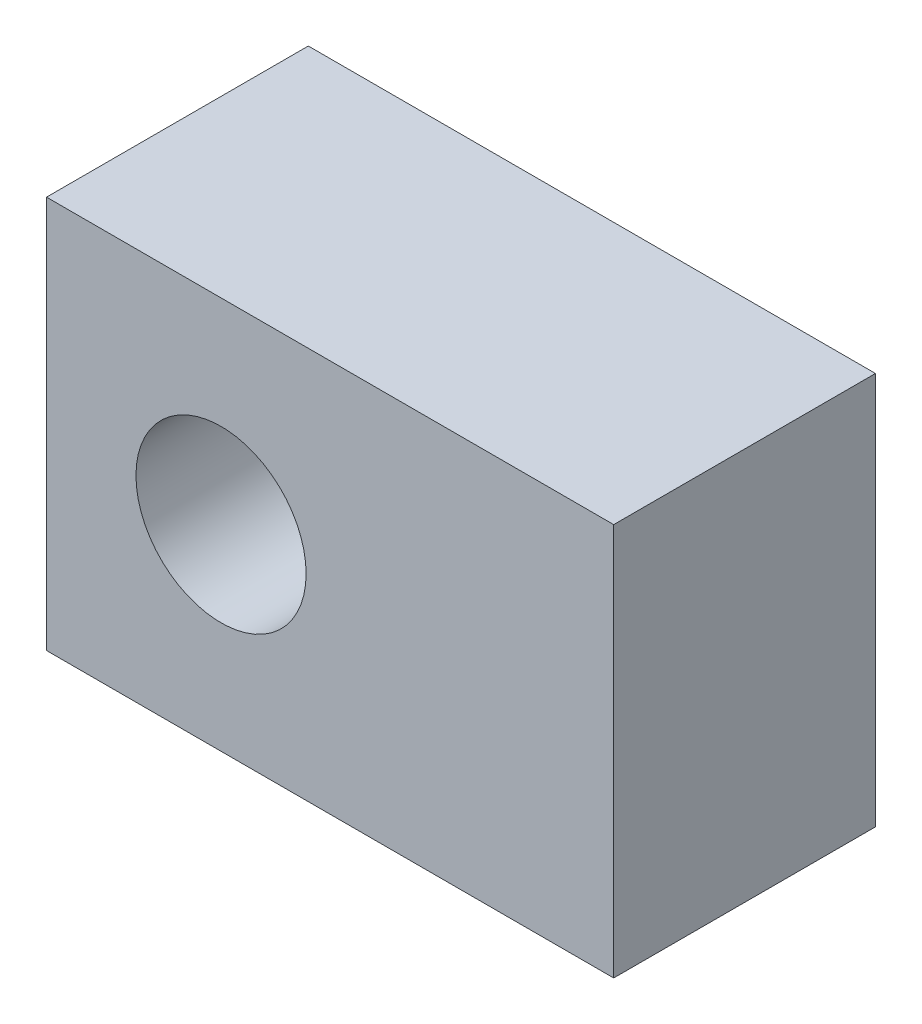
ISO-10303-21;
HEADER;
FILE_DESCRIPTION(('STEP AP214'),'2;1');
FILE_NAME('part.step','',(''),(''),'','','');
FILE_SCHEMA(('AUTOMOTIVE_DESIGN { 1 0 10303 214 1 1 1 1 }'));
ENDSEC;
DATA;
#1=APPLICATION_CONTEXT('core data for automotive mechanical design processes');
#2=APPLICATION_PROTOCOL_DEFINITION('international standard','automotive_design',2000,#1);
#3=PRODUCT_CONTEXT('',#1,'mechanical');
#4=PRODUCT('Part','Part','',(#3));
#5=PRODUCT_RELATED_PRODUCT_CATEGORY('part','',(#4));
#6=PRODUCT_DEFINITION_FORMATION('','',#4);
#7=PRODUCT_DEFINITION_CONTEXT('part definition',#1,'design');
#8=PRODUCT_DEFINITION('design','',#6,#7);
#9=PRODUCT_DEFINITION_SHAPE('','',#8);
#10=(LENGTH_UNIT() NAMED_UNIT(*) SI_UNIT(.MILLI.,.METRE.));
#11=(NAMED_UNIT(*) PLANE_ANGLE_UNIT() SI_UNIT($,.RADIAN.));
#12=(NAMED_UNIT(*) SI_UNIT($,.STERADIAN.) SOLID_ANGLE_UNIT());
#13=UNCERTAINTY_MEASURE_WITH_UNIT(LENGTH_MEASURE(1.E-05),#10,'distance_accuracy_value','');
#14=(GEOMETRIC_REPRESENTATION_CONTEXT(3) GLOBAL_UNCERTAINTY_ASSIGNED_CONTEXT((#13)) GLOBAL_UNIT_ASSIGNED_CONTEXT((#10,
#11,#12)) REPRESENTATION_CONTEXT('',''));
#15=CARTESIAN_POINT('',(0.,0.,0.));
#16=DIRECTION('',(0.,0.,1.));
#17=DIRECTION('',(1.,0.,0.));
#18=AXIS2_PLACEMENT_3D('',#15,#16,#17);
#19=CARTESIAN_POINT('',(-14.845632514959,8.82334762681522,6.));
#20=DIRECTION('',(1.,0.,0.));
#21=DIRECTION('',(0.,1.,0.));
#22=AXIS2_PLACEMENT_3D('',#19,#20,#21);
#23=PLANE('',#22);
#24=DIRECTION('',(0.,-1.,0.));
#25=VECTOR('',#24,1.);
#26=CARTESIAN_POINT('',(-14.845632514959,8.82334762681522,0.));
#27=LINE('',#26,#25);
#28=CARTESIAN_POINT('',(-14.845632514959,8.82334762681522,0.));
#29=VERTEX_POINT('',#28);
#30=CARTESIAN_POINT('',(-14.845632514959,-0.176652373184779,0.));
#31=VERTEX_POINT('',#30);
#32=EDGE_CURVE('E95',#29,#31,#27,.T.);
#33=ORIENTED_EDGE('',*,*,#32,.T.);
#34=DIRECTION('',(0.,0.,-1.));
#35=VECTOR('',#34,1.);
#36=CARTESIAN_POINT('',(-14.845632514959,-0.176652373184779,6.));
#37=LINE('',#36,#35);
#38=CARTESIAN_POINT('',(-14.845632514959,-0.176652373184779,6.));
#39=VERTEX_POINT('',#38);
#40=EDGE_CURVE('E11',#39,#31,#37,.T.);
#41=ORIENTED_EDGE('',*,*,#40,.F.);
#42=DIRECTION('',(0.,-1.,0.));
#43=VECTOR('',#42,1.);
#44=CARTESIAN_POINT('',(-14.845632514959,8.82334762681522,6.));
#45=LINE('',#44,#43);
#46=CARTESIAN_POINT('',(-14.845632514959,8.82334762681522,6.));
#47=VERTEX_POINT('',#46);
#48=EDGE_CURVE('E82',#47,#39,#45,.T.);
#49=ORIENTED_EDGE('',*,*,#48,.F.);
#50=DIRECTION('',(0.,0.,-1.));
#51=VECTOR('',#50,1.);
#52=CARTESIAN_POINT('',(-14.845632514959,8.82334762681522,6.));
#53=LINE('',#52,#51);
#54=EDGE_CURVE('E91',#47,#29,#53,.T.);
#55=ORIENTED_EDGE('',*,*,#54,.T.);
#56=EDGE_LOOP('',(#33,#41,#49,#55));
#57=FACE_BOUND('',#56,.T.);
#58=ADVANCED_FACE('F30',(#57),#23,.F.);
#59=CARTESIAN_POINT('',(-14.845632514959,-0.176652373184779,6.));
#60=DIRECTION('',(0.,1.,0.));
#61=DIRECTION('',(0.,0.,1.));
#62=AXIS2_PLACEMENT_3D('',#59,#60,#61);
#63=PLANE('',#62);
#64=DIRECTION('',(1.,0.,0.));
#65=VECTOR('',#64,1.);
#66=CARTESIAN_POINT('',(-14.845632514959,-0.176652373184779,0.));
#67=LINE('',#66,#65);
#68=CARTESIAN_POINT('',(-1.84563251495896,-0.176652373184779,0.));
#69=VERTEX_POINT('',#68);
#70=EDGE_CURVE('E86',#31,#69,#67,.T.);
#71=ORIENTED_EDGE('',*,*,#70,.T.);
#72=DIRECTION('',(0.,0.,-1.));
#73=VECTOR('',#72,1.);
#74=CARTESIAN_POINT('',(-1.84563251495896,-0.176652373184779,6.));
#75=LINE('',#74,#73);
#76=CARTESIAN_POINT('',(-1.84563251495896,-0.176652373184779,6.));
#77=VERTEX_POINT('',#76);
#78=EDGE_CURVE('E39',#77,#69,#75,.T.);
#79=ORIENTED_EDGE('',*,*,#78,.F.);
#80=DIRECTION('',(1.,0.,0.));
#81=VECTOR('',#80,1.);
#82=CARTESIAN_POINT('',(-14.845632514959,-0.176652373184779,6.));
#83=LINE('',#82,#81);
#84=EDGE_CURVE('E77',#39,#77,#83,.T.);
#85=ORIENTED_EDGE('',*,*,#84,.F.);
#86=ORIENTED_EDGE('',*,*,#40,.T.);
#87=EDGE_LOOP('',(#71,#79,#85,#86));
#88=FACE_BOUND('',#87,.T.);
#89=ADVANCED_FACE('F85',(#88),#63,.F.);
#90=CARTESIAN_POINT('',(-1.84563251495896,8.82334762681522,6.));
#91=DIRECTION('',(-1.,0.,0.));
#92=DIRECTION('',(0.,-1.,0.));
#93=AXIS2_PLACEMENT_3D('',#90,#91,#92);
#94=PLANE('',#93);
#95=DIRECTION('',(0.,1.,0.));
#96=VECTOR('',#95,1.);
#97=CARTESIAN_POINT('',(-1.84563251495896,8.82334762681522,0.));
#98=LINE('',#97,#96);
#99=CARTESIAN_POINT('',(-1.84563251495896,8.82334762681522,0.));
#100=VERTEX_POINT('',#99);
#101=EDGE_CURVE('E64',#69,#100,#98,.T.);
#102=ORIENTED_EDGE('',*,*,#101,.T.);
#103=DIRECTION('',(0.,0.,-1.));
#104=VECTOR('',#103,1.);
#105=CARTESIAN_POINT('',(-1.84563251495896,8.82334762681522,6.));
#106=LINE('',#105,#104);
#107=CARTESIAN_POINT('',(-1.84563251495896,8.82334762681522,6.));
#108=VERTEX_POINT('',#107);
#109=EDGE_CURVE('E87',#108,#100,#106,.T.);
#110=ORIENTED_EDGE('',*,*,#109,.F.);
#111=DIRECTION('',(0.,1.,0.));
#112=VECTOR('',#111,1.);
#113=CARTESIAN_POINT('',(-1.84563251495896,8.82334762681522,6.));
#114=LINE('',#113,#112);
#115=EDGE_CURVE('E80',#77,#108,#114,.T.);
#116=ORIENTED_EDGE('',*,*,#115,.F.);
#117=ORIENTED_EDGE('',*,*,#78,.T.);
#118=EDGE_LOOP('',(#102,#110,#116,#117));
#119=FACE_BOUND('',#118,.T.);
#120=ADVANCED_FACE('F89',(#119),#94,.F.);
#121=CARTESIAN_POINT('',(-14.845632514959,8.82334762681522,6.));
#122=DIRECTION('',(0.,-1.,0.));
#123=DIRECTION('',(0.,0.,-1.));
#124=AXIS2_PLACEMENT_3D('',#121,#122,#123);
#125=PLANE('',#124);
#126=DIRECTION('',(-1.,0.,0.));
#127=VECTOR('',#126,1.);
#128=CARTESIAN_POINT('',(-14.845632514959,8.82334762681522,0.));
#129=LINE('',#128,#127);
#130=EDGE_CURVE('E70',#100,#29,#129,.T.);
#131=ORIENTED_EDGE('',*,*,#130,.T.);
#132=ORIENTED_EDGE('',*,*,#54,.F.);
#133=DIRECTION('',(-1.,0.,0.));
#134=VECTOR('',#133,1.);
#135=CARTESIAN_POINT('',(-14.845632514959,8.82334762681522,6.));
#136=LINE('',#135,#134);
#137=EDGE_CURVE('E47',#108,#47,#136,.T.);
#138=ORIENTED_EDGE('',*,*,#137,.F.);
#139=ORIENTED_EDGE('',*,*,#109,.T.);
#140=EDGE_LOOP('',(#131,#132,#138,#139));
#141=FACE_BOUND('',#140,.T.);
#142=ADVANCED_FACE('F102',(#141),#125,.F.);
#143=CARTESIAN_POINT('',(-14.845632514959,-0.176652373184779,6.));
#144=DIRECTION('',(0.,0.,1.));
#145=DIRECTION('',(1.,0.,0.));
#146=AXIS2_PLACEMENT_3D('',#143,#144,#145);
#147=PLANE('',#146);
#148=CARTESIAN_POINT('',(-10.845632514959,4.32334762681522,6.));
#149=DIRECTION('',(0.,0.,1.));
#150=DIRECTION('',(1.,0.,0.));
#151=AXIS2_PLACEMENT_3D('',#148,#149,#150);
#152=CIRCLE('',#151,1.95);
#153=CARTESIAN_POINT('',(-8.89563251495896,4.32334762681522,6.));
#154=VERTEX_POINT('',#153);
#155=EDGE_CURVE('E108',#154,#154,#152,.T.);
#156=ORIENTED_EDGE('',*,*,#155,.F.);
#157=EDGE_LOOP('',(#156));
#158=FACE_BOUND('',#157,.T.);
#159=ORIENTED_EDGE('',*,*,#48,.T.);
#160=ORIENTED_EDGE('',*,*,#84,.T.);
#161=ORIENTED_EDGE('',*,*,#115,.T.);
#162=ORIENTED_EDGE('',*,*,#137,.T.);
#163=EDGE_LOOP('',(#159,#160,#161,#162));
#164=FACE_BOUND('',#163,.T.);
#165=ADVANCED_FACE('F78',(#158,#164),#147,.T.);
#166=CARTESIAN_POINT('',(-14.845632514959,-0.176652373184779,0.));
#167=DIRECTION('',(0.,0.,1.));
#168=DIRECTION('',(1.,0.,0.));
#169=AXIS2_PLACEMENT_3D('',#166,#167,#168);
#170=PLANE('',#169);
#171=CARTESIAN_POINT('',(-10.845632514959,4.32334762681522,0.));
#172=DIRECTION('',(0.,0.,1.));
#173=DIRECTION('',(1.,0.,0.));
#174=AXIS2_PLACEMENT_3D('',#171,#172,#173);
#175=CIRCLE('',#174,1.95);
#176=CARTESIAN_POINT('',(-8.89563251495896,4.32334762681522,0.));
#177=VERTEX_POINT('',#176);
#178=EDGE_CURVE('E33',#177,#177,#175,.T.);
#179=ORIENTED_EDGE('',*,*,#178,.T.);
#180=EDGE_LOOP('',(#179));
#181=FACE_BOUND('',#180,.T.);
#182=ORIENTED_EDGE('',*,*,#32,.F.);
#183=ORIENTED_EDGE('',*,*,#130,.F.);
#184=ORIENTED_EDGE('',*,*,#101,.F.);
#185=ORIENTED_EDGE('',*,*,#70,.F.);
#186=EDGE_LOOP('',(#182,#183,#184,#185));
#187=FACE_BOUND('',#186,.T.);
#188=ADVANCED_FACE('F105',(#181,#187),#170,.F.);
#189=CARTESIAN_POINT('',(-10.845632514959,4.32334762681522,-10.));
#190=DIRECTION('',(0.,0.,1.));
#191=DIRECTION('',(1.,0.,0.));
#192=AXIS2_PLACEMENT_3D('',#189,#190,#191);
#193=CYLINDRICAL_SURFACE('',#192,1.95);
#194=ORIENTED_EDGE('',*,*,#155,.T.);
#195=EDGE_LOOP('',(#194));
#196=FACE_BOUND('',#195,.T.);
#197=ORIENTED_EDGE('',*,*,#178,.F.);
#198=EDGE_LOOP('',(#197));
#199=FACE_BOUND('',#198,.T.);
#200=ADVANCED_FACE('F116',(#196,#199),#193,.F.);
#201=CLOSED_SHELL('',(#58,#89,#120,#142,#165,#188,#200));
#202=MANIFOLD_SOLID_BREP('B2',#201);
#203=ADVANCED_BREP_SHAPE_REPRESENTATION('',(#18,#202),#14);
#204=SHAPE_DEFINITION_REPRESENTATION(#9,#203);
ENDSEC;
END-ISO-10303-21;
